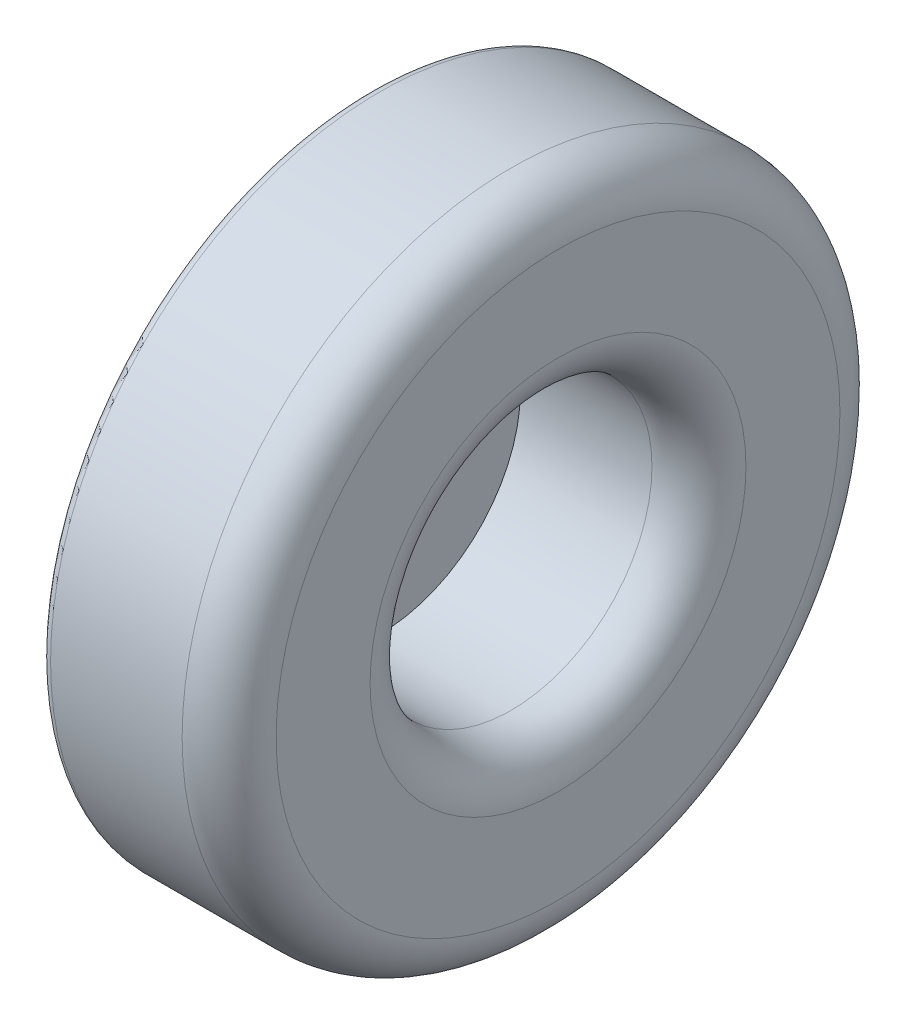
ISO-10303-21;
HEADER;
FILE_DESCRIPTION(('STEP AP214'),'2;1');
FILE_NAME('part.step','',(''),(''),'','','');
FILE_SCHEMA(('AUTOMOTIVE_DESIGN { 1 0 10303 214 1 1 1 1 }'));
ENDSEC;
DATA;
#1=APPLICATION_CONTEXT('core data for automotive mechanical design processes');
#2=APPLICATION_PROTOCOL_DEFINITION('international standard','automotive_design',2000,#1);
#3=PRODUCT_CONTEXT('',#1,'mechanical');
#4=PRODUCT('Part','Part','',(#3));
#5=PRODUCT_RELATED_PRODUCT_CATEGORY('part','',(#4));
#6=PRODUCT_DEFINITION_FORMATION('','',#4);
#7=PRODUCT_DEFINITION_CONTEXT('part definition',#1,'design');
#8=PRODUCT_DEFINITION('design','',#6,#7);
#9=PRODUCT_DEFINITION_SHAPE('','',#8);
#10=(LENGTH_UNIT() NAMED_UNIT(*) SI_UNIT(.MILLI.,.METRE.));
#11=(NAMED_UNIT(*) PLANE_ANGLE_UNIT() SI_UNIT($,.RADIAN.));
#12=(NAMED_UNIT(*) SI_UNIT($,.STERADIAN.) SOLID_ANGLE_UNIT());
#13=UNCERTAINTY_MEASURE_WITH_UNIT(LENGTH_MEASURE(1.E-05),#10,'distance_accuracy_value','');
#14=(GEOMETRIC_REPRESENTATION_CONTEXT(3) GLOBAL_UNCERTAINTY_ASSIGNED_CONTEXT((#13)) GLOBAL_UNIT_ASSIGNED_CONTEXT((#10,
#11,#12)) REPRESENTATION_CONTEXT('',''));
#15=CARTESIAN_POINT('',(0.,0.,0.));
#16=DIRECTION('',(0.,0.,1.));
#17=DIRECTION('',(1.,0.,0.));
#18=AXIS2_PLACEMENT_3D('',#15,#16,#17);
#19=CARTESIAN_POINT('',(20.,0.,0.));
#20=DIRECTION('',(-1.,0.,0.));
#21=DIRECTION('',(0.,0.,1.));
#22=AXIS2_PLACEMENT_3D('',#19,#20,#21);
#23=CYLINDRICAL_SURFACE('',#22,35.);
#24=CARTESIAN_POINT('',(1.,0.,0.));
#25=DIRECTION('',(1.,0.,0.));
#26=DIRECTION('',(0.,0.,-1.));
#27=AXIS2_PLACEMENT_3D('',#24,#25,#26);
#28=CIRCLE('',#27,35.);
#29=CARTESIAN_POINT('',(1.,0.,-35.));
#30=VERTEX_POINT('',#29);
#31=EDGE_CURVE('E39',#30,#30,#28,.T.);
#32=ORIENTED_EDGE('',*,*,#31,.T.);
#33=EDGE_LOOP('',(#32));
#34=FACE_BOUND('',#33,.T.);
#35=CARTESIAN_POINT('',(15.,0.,0.));
#36=DIRECTION('',(1.,0.,0.));
#37=DIRECTION('',(0.,0.,-1.));
#38=AXIS2_PLACEMENT_3D('',#35,#36,#37);
#39=CIRCLE('',#38,35.);
#40=CARTESIAN_POINT('',(15.,0.,-35.));
#41=VERTEX_POINT('',#40);
#42=EDGE_CURVE('E47',#41,#41,#39,.F.);
#43=ORIENTED_EDGE('',*,*,#42,.T.);
#44=EDGE_LOOP('',(#43));
#45=FACE_BOUND('',#44,.T.);
#46=ADVANCED_FACE('F32',(#34,#45),#23,.T.);
#47=CARTESIAN_POINT('',(20.,0.,0.));
#48=DIRECTION('',(1.,0.,0.));
#49=DIRECTION('',(0.,0.,-1.));
#50=AXIS2_PLACEMENT_3D('',#47,#48,#49);
#51=PLANE('',#50);
#52=CARTESIAN_POINT('',(20.,0.,0.));
#53=DIRECTION('',(1.,0.,0.));
#54=DIRECTION('',(0.,0.,-1.));
#55=AXIS2_PLACEMENT_3D('',#52,#53,#54);
#56=CIRCLE('',#55,30.);
#57=CARTESIAN_POINT('',(20.,0.,-30.));
#58=VERTEX_POINT('',#57);
#59=EDGE_CURVE('E52',#58,#58,#56,.T.);
#60=ORIENTED_EDGE('',*,*,#59,.T.);
#61=EDGE_LOOP('',(#60));
#62=FACE_BOUND('',#61,.T.);
#63=CARTESIAN_POINT('',(20.,0.,0.));
#64=DIRECTION('',(1.,0.,0.));
#65=DIRECTION('',(0.,0.,-1.));
#66=AXIS2_PLACEMENT_3D('',#63,#64,#65);
#67=CIRCLE('',#66,20.);
#68=CARTESIAN_POINT('',(20.,0.,-20.));
#69=VERTEX_POINT('',#68);
#70=EDGE_CURVE('E55',#69,#69,#67,.F.);
#71=ORIENTED_EDGE('',*,*,#70,.T.);
#72=EDGE_LOOP('',(#71));
#73=FACE_BOUND('',#72,.T.);
#74=ADVANCED_FACE('F75',(#62,#73),#51,.T.);
#75=CARTESIAN_POINT('',(0.,0.,0.));
#76=DIRECTION('',(1.,0.,0.));
#77=DIRECTION('',(0.,0.,-1.));
#78=AXIS2_PLACEMENT_3D('',#75,#76,#77);
#79=PLANE('',#78);
#80=CARTESIAN_POINT('',(0.,0.,0.));
#81=DIRECTION('',(1.,0.,0.));
#82=DIRECTION('',(0.,0.,-1.));
#83=AXIS2_PLACEMENT_3D('',#80,#81,#82);
#84=CIRCLE('',#83,34.);
#85=CARTESIAN_POINT('',(0.,0.,-34.));
#86=VERTEX_POINT('',#85);
#87=EDGE_CURVE('E10',#86,#86,#84,.F.);
#88=ORIENTED_EDGE('',*,*,#87,.T.);
#89=EDGE_LOOP('',(#88));
#90=FACE_BOUND('',#89,.T.);
#91=ADVANCED_FACE('F66',(#90),#79,.F.);
#92=CARTESIAN_POINT('',(1.,0.,0.));
#93=DIRECTION('',(1.,0.,0.));
#94=DIRECTION('',(0.,0.,-1.));
#95=AXIS2_PLACEMENT_3D('',#92,#93,#94);
#96=CYLINDRICAL_SURFACE('',#95,15.);
#97=CARTESIAN_POINT('',(15.,0.,0.));
#98=DIRECTION('',(1.,0.,0.));
#99=DIRECTION('',(0.,0.,-1.));
#100=AXIS2_PLACEMENT_3D('',#97,#98,#99);
#101=CIRCLE('',#100,15.);
#102=CARTESIAN_POINT('',(15.,0.,-15.));
#103=VERTEX_POINT('',#102);
#104=EDGE_CURVE('E43',#103,#103,#101,.T.);
#105=ORIENTED_EDGE('',*,*,#104,.T.);
#106=EDGE_LOOP('',(#105));
#107=FACE_BOUND('',#106,.T.);
#108=CARTESIAN_POINT('',(1.,0.,0.));
#109=DIRECTION('',(1.,0.,0.));
#110=DIRECTION('',(0.,0.,-1.));
#111=AXIS2_PLACEMENT_3D('',#108,#109,#110);
#112=CIRCLE('',#111,15.);
#113=CARTESIAN_POINT('',(1.,0.,-15.));
#114=VERTEX_POINT('',#113);
#115=EDGE_CURVE('E58',#114,#114,#112,.T.);
#116=ORIENTED_EDGE('',*,*,#115,.F.);
#117=EDGE_LOOP('',(#116));
#118=FACE_BOUND('',#117,.T.);
#119=ADVANCED_FACE('F64',(#107,#118),#96,.F.);
#120=CARTESIAN_POINT('',(1.,0.,0.));
#121=DIRECTION('',(1.,0.,0.));
#122=DIRECTION('',(0.,0.,-1.));
#123=AXIS2_PLACEMENT_3D('',#120,#121,#122);
#124=PLANE('',#123);
#125=ORIENTED_EDGE('',*,*,#115,.T.);
#126=EDGE_LOOP('',(#125));
#127=FACE_BOUND('',#126,.T.);
#128=ADVANCED_FACE('F62',(#127),#124,.T.);
#129=CARTESIAN_POINT('',(15.,0.,0.));
#130=DIRECTION('',(1.,0.,0.));
#131=DIRECTION('',(0.,0.,-1.));
#132=AXIS2_PLACEMENT_3D('',#129,#130,#131);
#133=TOROIDAL_SURFACE('',#132,30.,5.);
#134=ORIENTED_EDGE('',*,*,#42,.F.);
#135=EDGE_LOOP('',(#134));
#136=FACE_BOUND('',#135,.T.);
#137=ORIENTED_EDGE('',*,*,#59,.F.);
#138=EDGE_LOOP('',(#137));
#139=FACE_BOUND('',#138,.T.);
#140=ADVANCED_FACE('F73',(#136,#139),#133,.T.);
#141=CARTESIAN_POINT('',(15.,0.,0.));
#142=DIRECTION('',(1.,0.,0.));
#143=DIRECTION('',(0.,0.,-1.));
#144=AXIS2_PLACEMENT_3D('',#141,#142,#143);
#145=TOROIDAL_SURFACE('',#144,20.,5.);
#146=ORIENTED_EDGE('',*,*,#70,.F.);
#147=EDGE_LOOP('',(#146));
#148=FACE_BOUND('',#147,.T.);
#149=ORIENTED_EDGE('',*,*,#104,.F.);
#150=EDGE_LOOP('',(#149));
#151=FACE_BOUND('',#150,.T.);
#152=ADVANCED_FACE('F87',(#148,#151),#145,.T.);
#153=CARTESIAN_POINT('',(1.,0.,0.));
#154=DIRECTION('',(1.,0.,0.));
#155=DIRECTION('',(0.,0.,-1.));
#156=AXIS2_PLACEMENT_3D('',#153,#154,#155);
#157=TOROIDAL_SURFACE('',#156,34.,1.);
#158=ORIENTED_EDGE('',*,*,#87,.F.);
#159=EDGE_LOOP('',(#158));
#160=FACE_BOUND('',#159,.T.);
#161=ORIENTED_EDGE('',*,*,#31,.F.);
#162=EDGE_LOOP('',(#161));
#163=FACE_BOUND('',#162,.T.);
#164=ADVANCED_FACE('F34',(#160,#163),#157,.T.);
#165=CLOSED_SHELL('',(#46,#74,#91,#119,#128,#140,#152,#164));
#166=MANIFOLD_SOLID_BREP('B2',#165);
#167=ADVANCED_BREP_SHAPE_REPRESENTATION('',(#18,#166),#14);
#168=SHAPE_DEFINITION_REPRESENTATION(#9,#167);
ENDSEC;
END-ISO-10303-21;
